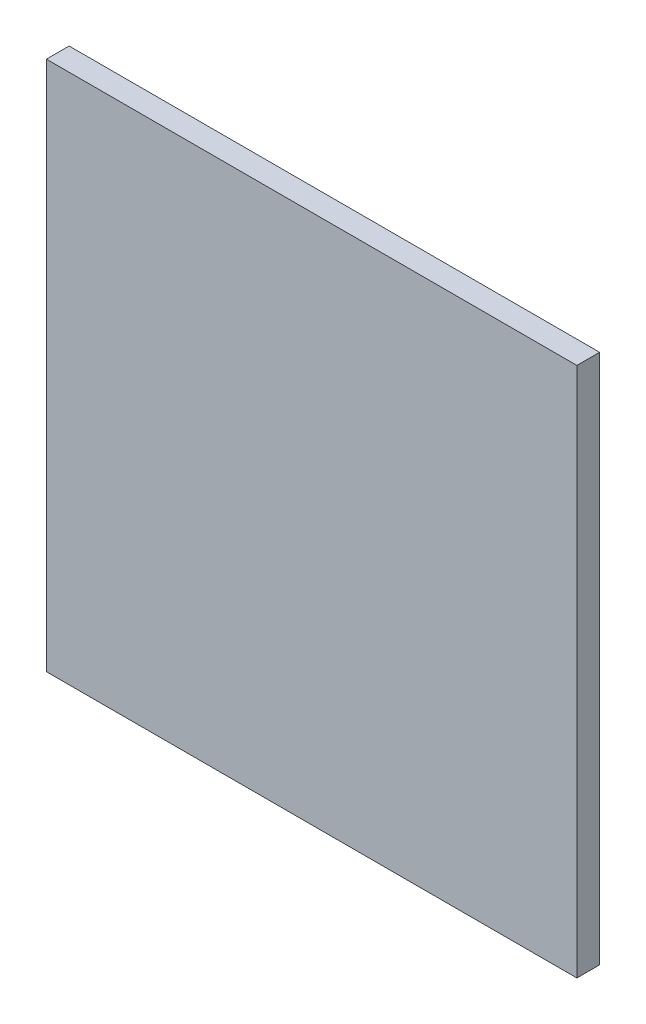
ISO-10303-21;
HEADER;
FILE_DESCRIPTION(('STEP AP214'),'2;1');
FILE_NAME('part.step','',(''),(''),'','','');
FILE_SCHEMA(('AUTOMOTIVE_DESIGN { 1 0 10303 214 1 1 1 1 }'));
ENDSEC;
DATA;
#1=APPLICATION_CONTEXT('core data for automotive mechanical design processes');
#2=APPLICATION_PROTOCOL_DEFINITION('international standard','automotive_design',2000,#1);
#3=PRODUCT_CONTEXT('',#1,'mechanical');
#4=PRODUCT('Part','Part','',(#3));
#5=PRODUCT_RELATED_PRODUCT_CATEGORY('part','',(#4));
#6=PRODUCT_DEFINITION_FORMATION('','',#4);
#7=PRODUCT_DEFINITION_CONTEXT('part definition',#1,'design');
#8=PRODUCT_DEFINITION('design','',#6,#7);
#9=PRODUCT_DEFINITION_SHAPE('','',#8);
#10=(LENGTH_UNIT() NAMED_UNIT(*) SI_UNIT(.MILLI.,.METRE.));
#11=(NAMED_UNIT(*) PLANE_ANGLE_UNIT() SI_UNIT($,.RADIAN.));
#12=(NAMED_UNIT(*) SI_UNIT($,.STERADIAN.) SOLID_ANGLE_UNIT());
#13=UNCERTAINTY_MEASURE_WITH_UNIT(LENGTH_MEASURE(1.E-05),#10,'distance_accuracy_value','');
#14=(GEOMETRIC_REPRESENTATION_CONTEXT(3) GLOBAL_UNCERTAINTY_ASSIGNED_CONTEXT((#13)) GLOBAL_UNIT_ASSIGNED_CONTEXT((#10,
#11,#12)) REPRESENTATION_CONTEXT('',''));
#15=CARTESIAN_POINT('',(0.,0.,0.));
#16=DIRECTION('',(0.,0.,1.));
#17=DIRECTION('',(1.,0.,0.));
#18=AXIS2_PLACEMENT_3D('',#15,#16,#17);
#19=CARTESIAN_POINT('',(12.55008,10.55,0.));
#20=DIRECTION('',(0.,0.,-1.));
#21=DIRECTION('',(-1.,0.,0.));
#22=AXIS2_PLACEMENT_3D('',#19,#20,#21);
#23=PLANE('',#22);
#24=DIRECTION('',(1.,0.,0.));
#25=VECTOR('',#24,1.);
#26=CARTESIAN_POINT('',(12.15008,10.95,0.));
#27=LINE('',#26,#25);
#28=CARTESIAN_POINT('',(12.15008,10.95,0.));
#29=VERTEX_POINT('',#28);
#30=CARTESIAN_POINT('',(12.95008,10.95,0.));
#31=VERTEX_POINT('',#30);
#32=EDGE_CURVE('E55',#29,#31,#27,.T.);
#33=ORIENTED_EDGE('',*,*,#32,.T.);
#34=DIRECTION('',(0.,1.,0.));
#35=VECTOR('',#34,1.);
#36=CARTESIAN_POINT('',(12.95008,10.95,0.));
#37=LINE('',#36,#35);
#38=CARTESIAN_POINT('',(12.95008,10.15,0.));
#39=VERTEX_POINT('',#38);
#40=EDGE_CURVE('E57',#31,#39,#37,.F.);
#41=ORIENTED_EDGE('',*,*,#40,.T.);
#42=DIRECTION('',(1.,0.,0.));
#43=VECTOR('',#42,1.);
#44=CARTESIAN_POINT('',(12.95008,10.15,0.));
#45=LINE('',#44,#43);
#46=CARTESIAN_POINT('',(12.15008,10.15,0.));
#47=VERTEX_POINT('',#46);
#48=EDGE_CURVE('E20',#39,#47,#45,.F.);
#49=ORIENTED_EDGE('',*,*,#48,.T.);
#50=DIRECTION('',(0.,1.,0.));
#51=VECTOR('',#50,1.);
#52=CARTESIAN_POINT('',(12.15008,10.15,0.));
#53=LINE('',#52,#51);
#54=EDGE_CURVE('E80',#47,#29,#53,.T.);
#55=ORIENTED_EDGE('',*,*,#54,.T.);
#56=EDGE_LOOP('',(#33,#41,#49,#55));
#57=FACE_BOUND('',#56,.T.);
#58=ADVANCED_FACE('F17',(#57),#23,.T.);
#59=CARTESIAN_POINT('',(12.95008,10.15,0.));
#60=DIRECTION('',(0.,1.,0.));
#61=DIRECTION('',(0.,0.,1.));
#62=AXIS2_PLACEMENT_3D('',#59,#60,#61);
#63=PLANE('',#62);
#64=DIRECTION('',(0.,0.,-1.));
#65=VECTOR('',#64,1.);
#66=CARTESIAN_POINT('',(12.15008,10.15,0.));
#67=LINE('',#66,#65);
#68=CARTESIAN_POINT('',(12.15008,10.15,0.03429));
#69=VERTEX_POINT('',#68);
#70=EDGE_CURVE('E68',#69,#47,#67,.T.);
#71=ORIENTED_EDGE('',*,*,#70,.T.);
#72=ORIENTED_EDGE('',*,*,#48,.F.);
#73=DIRECTION('',(0.,0.,1.));
#74=VECTOR('',#73,1.);
#75=CARTESIAN_POINT('',(12.95008,10.15,0.));
#76=LINE('',#75,#74);
#77=CARTESIAN_POINT('',(12.95008,10.15,0.03429));
#78=VERTEX_POINT('',#77);
#79=EDGE_CURVE('E63',#39,#78,#76,.T.);
#80=ORIENTED_EDGE('',*,*,#79,.T.);
#81=DIRECTION('',(1.,0.,0.));
#82=VECTOR('',#81,1.);
#83=CARTESIAN_POINT('',(12.55008,10.15,0.03429));
#84=LINE('',#83,#82);
#85=EDGE_CURVE('E83',#69,#78,#84,.T.);
#86=ORIENTED_EDGE('',*,*,#85,.F.);
#87=EDGE_LOOP('',(#71,#72,#80,#86));
#88=FACE_BOUND('',#87,.T.);
#89=ADVANCED_FACE('F65',(#88),#63,.F.);
#90=CARTESIAN_POINT('',(12.95008,10.95,0.));
#91=DIRECTION('',(-1.,0.,0.));
#92=DIRECTION('',(0.,0.,1.));
#93=AXIS2_PLACEMENT_3D('',#90,#91,#92);
#94=PLANE('',#93);
#95=ORIENTED_EDGE('',*,*,#79,.F.);
#96=ORIENTED_EDGE('',*,*,#40,.F.);
#97=DIRECTION('',(0.,0.,-1.));
#98=VECTOR('',#97,1.);
#99=CARTESIAN_POINT('',(12.95008,10.95,0.));
#100=LINE('',#99,#98);
#101=CARTESIAN_POINT('',(12.95008,10.95,0.03429));
#102=VERTEX_POINT('',#101);
#103=EDGE_CURVE('E75',#31,#102,#100,.F.);
#104=ORIENTED_EDGE('',*,*,#103,.T.);
#105=DIRECTION('',(0.,1.,0.));
#106=VECTOR('',#105,1.);
#107=CARTESIAN_POINT('',(12.95008,10.55,0.03429));
#108=LINE('',#107,#106);
#109=EDGE_CURVE('E72',#78,#102,#108,.T.);
#110=ORIENTED_EDGE('',*,*,#109,.F.);
#111=EDGE_LOOP('',(#95,#96,#104,#110));
#112=FACE_BOUND('',#111,.T.);
#113=ADVANCED_FACE('F70',(#112),#94,.F.);
#114=CARTESIAN_POINT('',(12.15008,10.95,0.));
#115=DIRECTION('',(0.,-1.,0.));
#116=DIRECTION('',(0.,0.,-1.));
#117=AXIS2_PLACEMENT_3D('',#114,#115,#116);
#118=PLANE('',#117);
#119=ORIENTED_EDGE('',*,*,#103,.F.);
#120=ORIENTED_EDGE('',*,*,#32,.F.);
#121=DIRECTION('',(0.,0.,-1.));
#122=VECTOR('',#121,1.);
#123=CARTESIAN_POINT('',(12.15008,10.95,0.));
#124=LINE('',#123,#122);
#125=CARTESIAN_POINT('',(12.15008,10.95,0.03429));
#126=VERTEX_POINT('',#125);
#127=EDGE_CURVE('E35',#29,#126,#124,.F.);
#128=ORIENTED_EDGE('',*,*,#127,.T.);
#129=DIRECTION('',(1.,0.,0.));
#130=VECTOR('',#129,1.);
#131=CARTESIAN_POINT('',(12.55008,10.95,0.03429));
#132=LINE('',#131,#130);
#133=EDGE_CURVE('E26',#102,#126,#132,.F.);
#134=ORIENTED_EDGE('',*,*,#133,.F.);
#135=EDGE_LOOP('',(#119,#120,#128,#134));
#136=FACE_BOUND('',#135,.T.);
#137=ADVANCED_FACE('F89',(#136),#118,.F.);
#138=CARTESIAN_POINT('',(12.15008,10.15,0.));
#139=DIRECTION('',(1.,0.,0.));
#140=DIRECTION('',(0.,0.,-1.));
#141=AXIS2_PLACEMENT_3D('',#138,#139,#140);
#142=PLANE('',#141);
#143=ORIENTED_EDGE('',*,*,#127,.F.);
#144=ORIENTED_EDGE('',*,*,#54,.F.);
#145=ORIENTED_EDGE('',*,*,#70,.F.);
#146=DIRECTION('',(0.,1.,0.));
#147=VECTOR('',#146,1.);
#148=CARTESIAN_POINT('',(12.15008,10.55,0.03429));
#149=LINE('',#148,#147);
#150=EDGE_CURVE('E11',#126,#69,#149,.F.);
#151=ORIENTED_EDGE('',*,*,#150,.F.);
#152=EDGE_LOOP('',(#143,#144,#145,#151));
#153=FACE_BOUND('',#152,.T.);
#154=ADVANCED_FACE('F91',(#153),#142,.F.);
#155=CARTESIAN_POINT('',(12.55008,10.55,0.03429));
#156=DIRECTION('',(0.,0.,1.));
#157=DIRECTION('',(1.,0.,0.));
#158=AXIS2_PLACEMENT_3D('',#155,#156,#157);
#159=PLANE('',#158);
#160=ORIENTED_EDGE('',*,*,#133,.T.);
#161=ORIENTED_EDGE('',*,*,#150,.T.);
#162=ORIENTED_EDGE('',*,*,#85,.T.);
#163=ORIENTED_EDGE('',*,*,#109,.T.);
#164=EDGE_LOOP('',(#160,#161,#162,#163));
#165=FACE_BOUND('',#164,.T.);
#166=ADVANCED_FACE('F88',(#165),#159,.T.);
#167=CLOSED_SHELL('',(#58,#89,#113,#137,#154,#166));
#168=MANIFOLD_SOLID_BREP('B1',#167);
#169=ADVANCED_BREP_SHAPE_REPRESENTATION('',(#18,#168),#14);
#170=SHAPE_DEFINITION_REPRESENTATION(#9,#169);
ENDSEC;
END-ISO-10303-21;
